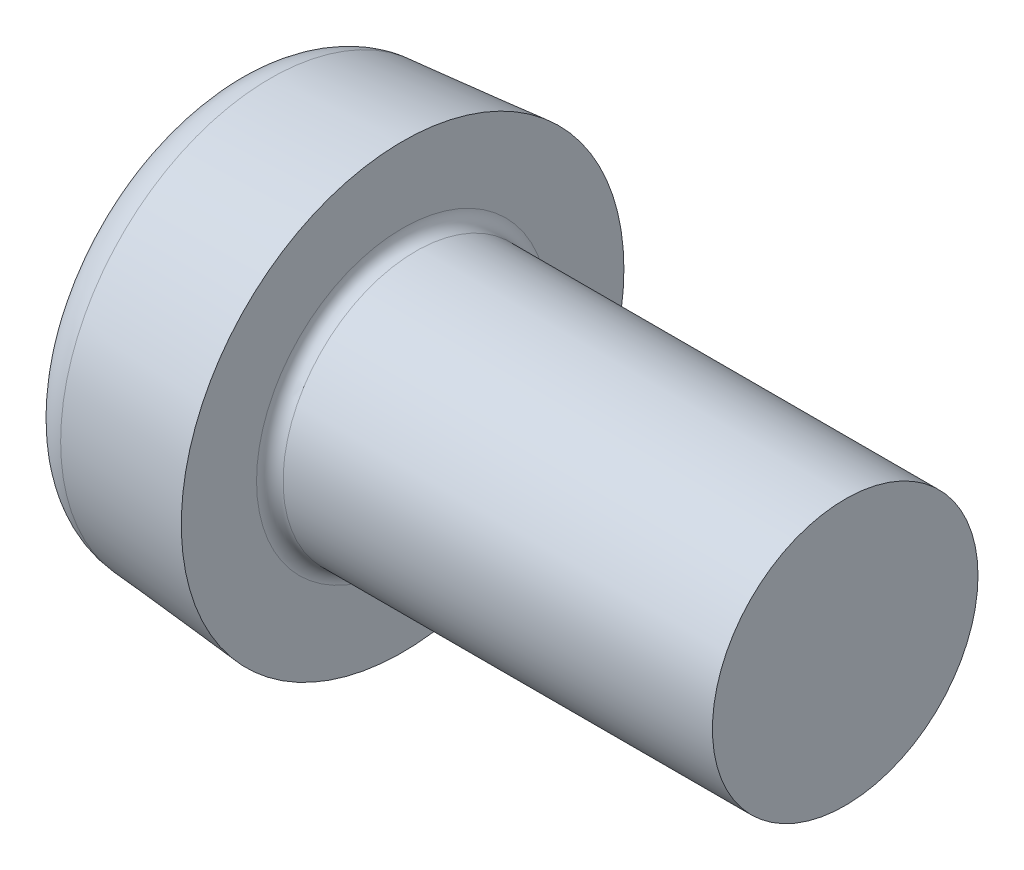
ISO-10303-21;
HEADER;
FILE_DESCRIPTION(('STEP AP214'),'2;1');
FILE_NAME('part.step','',(''),(''),'','','');
FILE_SCHEMA(('AUTOMOTIVE_DESIGN { 1 0 10303 214 1 1 1 1 }'));
ENDSEC;
DATA;
#1=APPLICATION_CONTEXT('core data for automotive mechanical design processes');
#2=APPLICATION_PROTOCOL_DEFINITION('international standard','automotive_design',2000,#1);
#3=PRODUCT_CONTEXT('',#1,'mechanical');
#4=PRODUCT('Part','Part','',(#3));
#5=PRODUCT_RELATED_PRODUCT_CATEGORY('part','',(#4));
#6=PRODUCT_DEFINITION_FORMATION('','',#4);
#7=PRODUCT_DEFINITION_CONTEXT('part definition',#1,'design');
#8=PRODUCT_DEFINITION('design','',#6,#7);
#9=PRODUCT_DEFINITION_SHAPE('','',#8);
#10=(LENGTH_UNIT() NAMED_UNIT(*) SI_UNIT(.MILLI.,.METRE.));
#11=(NAMED_UNIT(*) PLANE_ANGLE_UNIT() SI_UNIT($,.RADIAN.));
#12=(NAMED_UNIT(*) SI_UNIT($,.STERADIAN.) SOLID_ANGLE_UNIT());
#13=UNCERTAINTY_MEASURE_WITH_UNIT(LENGTH_MEASURE(1.E-05),#10,'distance_accuracy_value','');
#14=(GEOMETRIC_REPRESENTATION_CONTEXT(3) GLOBAL_UNCERTAINTY_ASSIGNED_CONTEXT((#13)) GLOBAL_UNIT_ASSIGNED_CONTEXT((#10,
#11,#12)) REPRESENTATION_CONTEXT('',''));
#15=CARTESIAN_POINT('',(0.,0.,0.));
#16=DIRECTION('',(0.,0.,1.));
#17=DIRECTION('',(1.,0.,0.));
#18=AXIS2_PLACEMENT_3D('',#15,#16,#17);
#19=CARTESIAN_POINT('',(0.,0.,0.));
#20=DIRECTION('',(-1.,0.,0.));
#21=DIRECTION('',(0.,0.,0.999999999999996));
#22=AXIS2_PLACEMENT_3D('',#19,#20,#21);
#23=PLANE('',#22);
#24=CARTESIAN_POINT('',(0.,0.,0.));
#25=DIRECTION('',(-1.,0.,0.));
#26=DIRECTION('',(0.,0.,0.999999999999996));
#27=AXIS2_PLACEMENT_3D('',#24,#25,#26);
#28=CIRCLE('',#27,3.74246303823146);
#29=CARTESIAN_POINT('',(0.,0.,3.74246303823145));
#30=VERTEX_POINT('',#29);
#31=EDGE_CURVE('E11',#30,#30,#28,.T.);
#32=ORIENTED_EDGE('',*,*,#31,.T.);
#33=EDGE_LOOP('',(#32));
#34=FACE_BOUND('',#33,.T.);
#35=DIRECTION('',(0.,0.,-0.999999999999997));
#36=VECTOR('',#35,1.);
#37=CARTESIAN_POINT('',(0.,-0.620000000000398,0.620000000000287));
#38=LINE('',#37,#36);
#39=CARTESIAN_POINT('',(0.,-0.620000000000287,3.10000000000021));
#40=VERTEX_POINT('',#39);
#41=CARTESIAN_POINT('',(0.,-0.62000000000037,0.920000000000309));
#42=VERTEX_POINT('',#41);
#43=EDGE_CURVE('E232',#40,#42,#38,.T.);
#44=ORIENTED_EDGE('',*,*,#43,.T.);
#45=CARTESIAN_POINT('',(0.,-0.92000000000042,0.920000000000476));
#46=DIRECTION('',(-1.,0.,0.));
#47=DIRECTION('',(0.,0.,0.999999999999996));
#48=AXIS2_PLACEMENT_3D('',#45,#46,#47);
#49=CIRCLE('',#48,0.3);
#50=CARTESIAN_POINT('',(0.,-0.920000000000198,0.620000000000176));
#51=VERTEX_POINT('',#50);
#52=EDGE_CURVE('E180',#42,#51,#49,.T.);
#53=ORIENTED_EDGE('',*,*,#52,.T.);
#54=DIRECTION('',(0.,-0.999999999999997,0.));
#55=VECTOR('',#54,1.);
#56=CARTESIAN_POINT('',(0.,-0.620000000000398,0.620000000000287));
#57=LINE('',#56,#55);
#58=CARTESIAN_POINT('',(0.,-3.10000000000019,0.620000000000287));
#59=VERTEX_POINT('',#58);
#60=EDGE_CURVE('E229',#51,#59,#57,.T.);
#61=ORIENTED_EDGE('',*,*,#60,.T.);
#62=DIRECTION('',(0.,0.,-0.999999999999996));
#63=VECTOR('',#62,1.);
#64=CARTESIAN_POINT('',(0.,-3.10000000000027,-0.619999999999843));
#65=LINE('',#64,#63);
#66=CARTESIAN_POINT('',(0.,-3.10000000000027,-0.619999999999843));
#67=VERTEX_POINT('',#66);
#68=EDGE_CURVE('E111',#59,#67,#65,.T.);
#69=ORIENTED_EDGE('',*,*,#68,.T.);
#70=DIRECTION('',(0.,0.999999999999996,0.));
#71=VECTOR('',#70,1.);
#72=CARTESIAN_POINT('',(0.,-0.620000000000162,-0.619999999999843));
#73=LINE('',#72,#71);
#74=CARTESIAN_POINT('',(0.,-0.92000000000024,-0.619999999999843));
#75=VERTEX_POINT('',#74);
#76=EDGE_CURVE('E225',#67,#75,#73,.T.);
#77=ORIENTED_EDGE('',*,*,#76,.T.);
#78=CARTESIAN_POINT('',(0.,-0.920000000000129,-0.919999999999699));
#79=DIRECTION('',(-1.,0.,0.));
#80=DIRECTION('',(0.,0.,0.999999999999996));
#81=AXIS2_PLACEMENT_3D('',#78,#79,#80);
#82=CIRCLE('',#81,0.3);
#83=CARTESIAN_POINT('',(0.,-0.620000000000176,-0.91999999999981));
#84=VERTEX_POINT('',#83);
#85=EDGE_CURVE('E183',#75,#84,#82,.T.);
#86=ORIENTED_EDGE('',*,*,#85,.T.);
#87=DIRECTION('',(0.,0.,-0.999999999999996));
#88=VECTOR('',#87,1.);
#89=CARTESIAN_POINT('',(0.,-0.620000000000162,-0.619999999999843));
#90=LINE('',#89,#88);
#91=CARTESIAN_POINT('',(0.,-0.62000000000037,-3.09999999999966));
#92=VERTEX_POINT('',#91);
#93=EDGE_CURVE('E222',#84,#92,#90,.T.);
#94=ORIENTED_EDGE('',*,*,#93,.T.);
#95=DIRECTION('',(0.,0.999999999999996,0.));
#96=VECTOR('',#95,1.);
#97=CARTESIAN_POINT('',(0.,0.619999999999676,-3.0999999999996));
#98=LINE('',#97,#96);
#99=CARTESIAN_POINT('',(0.,0.619999999999676,-3.0999999999996));
#100=VERTEX_POINT('',#99);
#101=EDGE_CURVE('E219',#92,#100,#98,.T.);
#102=ORIENTED_EDGE('',*,*,#101,.T.);
#103=DIRECTION('',(0.,0.,0.999999999999996));
#104=VECTOR('',#103,1.);
#105=CARTESIAN_POINT('',(0.,0.619999999999676,-0.619999999999732));
#106=LINE('',#105,#104);
#107=CARTESIAN_POINT('',(0.,0.619999999999801,-0.919999999999699));
#108=VERTEX_POINT('',#107);
#109=EDGE_CURVE('E216',#100,#108,#106,.T.);
#110=ORIENTED_EDGE('',*,*,#109,.T.);
#111=CARTESIAN_POINT('',(0.,0.919999999999754,-0.91999999999981));
#112=DIRECTION('',(-1.,0.,0.));
#113=DIRECTION('',(0.,0.,0.999999999999996));
#114=AXIS2_PLACEMENT_3D('',#111,#112,#113);
#115=CIRCLE('',#114,0.3);
#116=CARTESIAN_POINT('',(0.,0.919999999999616,-0.619999999999787));
#117=VERTEX_POINT('',#116);
#118=EDGE_CURVE('E189',#108,#117,#115,.T.);
#119=ORIENTED_EDGE('',*,*,#118,.T.);
#120=DIRECTION('',(0.,0.999999999999996,0.));
#121=VECTOR('',#120,1.);
#122=CARTESIAN_POINT('',(0.,0.619999999999676,-0.619999999999732));
#123=LINE('',#122,#121);
#124=CARTESIAN_POINT('',(0.,3.09999999999973,-0.619999999999732));
#125=VERTEX_POINT('',#124);
#126=EDGE_CURVE('E213',#117,#125,#123,.T.);
#127=ORIENTED_EDGE('',*,*,#126,.T.);
#128=DIRECTION('',(0.,0.,0.999999999999996));
#129=VECTOR('',#128,1.);
#130=CARTESIAN_POINT('',(0.,3.09999999999973,-0.619999999999732));
#131=LINE('',#130,#129);
#132=CARTESIAN_POINT('',(0.,3.09999999999985,0.620000000000287));
#133=VERTEX_POINT('',#132);
#134=EDGE_CURVE('E210',#125,#133,#131,.T.);
#135=ORIENTED_EDGE('',*,*,#134,.T.);
#136=DIRECTION('',(0.,-0.999999999999997,0.));
#137=VECTOR('',#136,1.);
#138=CARTESIAN_POINT('',(0.,0.619999999999843,0.620000000000176));
#139=LINE('',#138,#137);
#140=CARTESIAN_POINT('',(0.,0.919999999999851,0.620000000000287));
#141=VERTEX_POINT('',#140);
#142=EDGE_CURVE('E207',#133,#141,#139,.T.);
#143=ORIENTED_EDGE('',*,*,#142,.T.);
#144=CARTESIAN_POINT('',(0.,0.919999999999699,0.920000000000254));
#145=DIRECTION('',(-1.,0.,0.));
#146=DIRECTION('',(0.,0.,0.999999999999996));
#147=AXIS2_PLACEMENT_3D('',#144,#145,#146);
#148=CIRCLE('',#147,0.3);
#149=CARTESIAN_POINT('',(0.,0.619999999999774,0.920000000000254));
#150=VERTEX_POINT('',#149);
#151=EDGE_CURVE('E186',#141,#150,#148,.T.);
#152=ORIENTED_EDGE('',*,*,#151,.T.);
#153=DIRECTION('',(0.,0.,0.999999999999997));
#154=VECTOR('',#153,1.);
#155=CARTESIAN_POINT('',(0.,0.619999999999843,0.620000000000176));
#156=LINE('',#155,#154);
#157=CARTESIAN_POINT('',(0.,0.61999999999969,3.10000000000032));
#158=VERTEX_POINT('',#157);
#159=EDGE_CURVE('E238',#150,#158,#156,.T.);
#160=ORIENTED_EDGE('',*,*,#159,.T.);
#161=DIRECTION('',(0.,-0.999999999999997,0.));
#162=VECTOR('',#161,1.);
#163=CARTESIAN_POINT('',(0.,0.61999999999969,3.10000000000032));
#164=LINE('',#163,#162);
#165=EDGE_CURVE('E235',#158,#40,#164,.T.);
#166=ORIENTED_EDGE('',*,*,#165,.T.);
#167=EDGE_LOOP('',(#44,#53,#61,#69,#77,#86,#94,#102,#110,#119,#127,#135,#143,#152,#160,#166));
#168=FACE_BOUND('',#167,.T.);
#169=ADVANCED_FACE('F39',(#34,#168),#23,.T.);
#170=CARTESIAN_POINT('',(13.9,2.99999999999975,1.66533453693773E-13));
#171=DIRECTION('',(1.,0.,0.));
#172=DIRECTION('',(0.,0.,-0.999999999999996));
#173=AXIS2_PLACEMENT_3D('',#170,#171,#172);
#174=PLANE('',#173);
#175=CARTESIAN_POINT('',(13.9,0.,0.));
#176=DIRECTION('',(1.,0.,0.));
#177=DIRECTION('',(0.,0.,-0.999999999999996));
#178=AXIS2_PLACEMENT_3D('',#175,#176,#177);
#179=CIRCLE('',#178,3.);
#180=CARTESIAN_POINT('',(13.9,0.,-2.99999999999999));
#181=VERTEX_POINT('',#180);
#182=EDGE_CURVE('E195',#181,#181,#179,.T.);
#183=ORIENTED_EDGE('',*,*,#182,.T.);
#184=EDGE_LOOP('',(#183));
#185=FACE_BOUND('',#184,.T.);
#186=ADVANCED_FACE('F357',(#185),#174,.T.);
#187=CARTESIAN_POINT('',(4.51581291088132,0.,0.));
#188=DIRECTION('',(1.,0.,0.));
#189=DIRECTION('',(0.,0.,-0.999999999999996));
#190=AXIS2_PLACEMENT_3D('',#187,#188,#189);
#191=CYLINDRICAL_SURFACE('',#190,3.);
#192=CARTESIAN_POINT('',(4.2,0.,0.));
#193=DIRECTION('',(1.,0.,0.));
#194=DIRECTION('',(0.,0.,-0.999999999999996));
#195=AXIS2_PLACEMENT_3D('',#192,#193,#194);
#196=CIRCLE('',#195,3.);
#197=CARTESIAN_POINT('',(4.2,0.,-2.99999999999999));
#198=VERTEX_POINT('',#197);
#199=EDGE_CURVE('E198',#198,#198,#196,.T.);
#200=ORIENTED_EDGE('',*,*,#199,.T.);
#201=EDGE_LOOP('',(#200));
#202=FACE_BOUND('',#201,.T.);
#203=ORIENTED_EDGE('',*,*,#182,.F.);
#204=EDGE_LOOP('',(#203));
#205=FACE_BOUND('',#204,.T.);
#206=ADVANCED_FACE('F363',(#202,#205),#191,.T.);
#207=CARTESIAN_POINT('',(4.2,0.,0.));
#208=DIRECTION('',(1.,0.,0.));
#209=DIRECTION('',(0.,0.,-0.999999999999996));
#210=AXIS2_PLACEMENT_3D('',#207,#208,#209);
#211=TOROIDAL_SURFACE('',#210,3.3,0.3);
#212=CARTESIAN_POINT('',(3.9,0.,0.));
#213=DIRECTION('',(1.,0.,0.));
#214=DIRECTION('',(0.,0.,-0.999999999999996));
#215=AXIS2_PLACEMENT_3D('',#212,#213,#214);
#216=CIRCLE('',#215,3.3);
#217=CARTESIAN_POINT('',(3.9,0.,-3.29999999999999));
#218=VERTEX_POINT('',#217);
#219=EDGE_CURVE('E201',#218,#218,#216,.T.);
#220=ORIENTED_EDGE('',*,*,#219,.T.);
#221=EDGE_LOOP('',(#220));
#222=FACE_BOUND('',#221,.T.);
#223=ORIENTED_EDGE('',*,*,#199,.F.);
#224=EDGE_LOOP('',(#223));
#225=FACE_BOUND('',#224,.T.);
#226=ADVANCED_FACE('F374',(#222,#225),#211,.F.);
#227=CARTESIAN_POINT('',(3.89999999999998,3.29999999999975,1.66533453693773E-13));
#228=DIRECTION('',(1.,0.,0.));
#229=DIRECTION('',(0.,0.,-0.999999999999996));
#230=AXIS2_PLACEMENT_3D('',#227,#228,#229);
#231=PLANE('',#230);
#232=CARTESIAN_POINT('',(3.9,0.,0.));
#233=DIRECTION('',(1.,0.,0.));
#234=DIRECTION('',(0.,0.,-0.999999999999996));
#235=AXIS2_PLACEMENT_3D('',#232,#233,#234);
#236=CIRCLE('',#235,5.);
#237=CARTESIAN_POINT('',(3.9,0.,-4.99999999999998));
#238=VERTEX_POINT('',#237);
#239=EDGE_CURVE('E146',#238,#238,#236,.T.);
#240=ORIENTED_EDGE('',*,*,#239,.T.);
#241=EDGE_LOOP('',(#240));
#242=FACE_BOUND('',#241,.T.);
#243=ORIENTED_EDGE('',*,*,#219,.F.);
#244=EDGE_LOOP('',(#243));
#245=FACE_BOUND('',#244,.T.);
#246=ADVANCED_FACE('F370',(#242,#245),#231,.T.);
#247=CARTESIAN_POINT('',(3.9,0.,0.));
#248=DIRECTION('',(1.,0.,0.));
#249=DIRECTION('',(0.,0.,-0.999999999999996));
#250=AXIS2_PLACEMENT_3D('',#247,#248,#249);
#251=CONICAL_SURFACE('',#250,5.,0.08726646259972);
#252=CARTESIAN_POINT('',(0.912844257252333,0.,0.));
#253=DIRECTION('',(-1.,0.,0.));
#254=DIRECTION('',(0.,0.,0.999999999999996));
#255=AXIS2_PLACEMENT_3D('',#252,#253,#254);
#256=CIRCLE('',#255,4.73865773632321);
#257=CARTESIAN_POINT('',(0.912844257252333,0.,4.73865773632319));
#258=VERTEX_POINT('',#257);
#259=EDGE_CURVE('E49',#258,#258,#256,.F.);
#260=ORIENTED_EDGE('',*,*,#259,.T.);
#261=EDGE_LOOP('',(#260));
#262=FACE_BOUND('',#261,.T.);
#263=ORIENTED_EDGE('',*,*,#239,.F.);
#264=EDGE_LOOP('',(#263));
#265=FACE_BOUND('',#264,.T.);
#266=ADVANCED_FACE('F367',(#262,#265),#251,.T.);
#267=CARTESIAN_POINT('',(3.89999999999999,0.619999999999843,0.620000000000176));
#268=DIRECTION('',(0.,-0.999999999999997,0.));
#269=DIRECTION('',(0.,0.,-0.999999999999997));
#270=AXIS2_PLACEMENT_3D('',#267,#268,#269);
#271=PLANE('',#270);
#272=ORIENTED_EDGE('',*,*,#159,.F.);
#273=DIRECTION('',(-1.,0.,0.));
#274=VECTOR('',#273,1.);
#275=CARTESIAN_POINT('',(3.89999999999999,0.619999999999774,0.920000000000254));
#276=LINE('',#275,#274);
#277=CARTESIAN_POINT('',(3.89999999999999,0.619999999999774,0.920000000000254));
#278=VERTEX_POINT('',#277);
#279=EDGE_CURVE('E167',#150,#278,#276,.F.);
#280=ORIENTED_EDGE('',*,*,#279,.T.);
#281=DIRECTION('',(0.,0.,0.999999999999997));
#282=VECTOR('',#281,1.);
#283=CARTESIAN_POINT('',(3.89999999999999,0.619999999999843,0.620000000000176));
#284=LINE('',#283,#282);
#285=CARTESIAN_POINT('',(3.89999999999999,0.619999999999801,1.68051608636194));
#286=VERTEX_POINT('',#285);
#287=EDGE_CURVE('E149',#278,#286,#284,.T.);
#288=ORIENTED_EDGE('',*,*,#287,.T.);
#289=DIRECTION('',(-0.939692620785908,0.,0.342020143325668));
#290=VECTOR('',#289,1.);
#291=CARTESIAN_POINT('',(0.,0.61999999999969,3.10000000000032));
#292=LINE('',#291,#290);
#293=EDGE_CURVE('E143',#286,#158,#292,.T.);
#294=ORIENTED_EDGE('',*,*,#293,.T.);
#295=EDGE_LOOP('',(#272,#280,#288,#294));
#296=FACE_BOUND('',#295,.T.);
#297=ADVANCED_FACE('F252',(#296),#271,.T.);
#298=CARTESIAN_POINT('',(0.,0.61999999999969,3.10000000000032));
#299=DIRECTION('',(-0.342020143325669,0.,-0.939692620785904));
#300=DIRECTION('',(-0.939692620785908,0.,0.342020143325669));
#301=AXIS2_PLACEMENT_3D('',#298,#299,#300);
#302=PLANE('',#301);
#303=ORIENTED_EDGE('',*,*,#165,.F.);
#304=ORIENTED_EDGE('',*,*,#293,.F.);
#305=DIRECTION('',(0.,-0.999999999999997,0.));
#306=VECTOR('',#305,1.);
#307=CARTESIAN_POINT('',(3.89999999999999,0.619999999999801,1.68051608636194));
#308=LINE('',#307,#306);
#309=CARTESIAN_POINT('',(3.89999999999999,-0.620000000000329,1.68051608636199));
#310=VERTEX_POINT('',#309);
#311=EDGE_CURVE('E147',#286,#310,#308,.T.);
#312=ORIENTED_EDGE('',*,*,#311,.T.);
#313=DIRECTION('',(-0.939692620785908,0.,0.342020143325668));
#314=VECTOR('',#313,1.);
#315=CARTESIAN_POINT('',(4.24084330009331,-0.620000000000273,1.55645927057912));
#316=LINE('',#315,#314);
#317=EDGE_CURVE('E112',#310,#40,#316,.T.);
#318=ORIENTED_EDGE('',*,*,#317,.T.);
#319=EDGE_LOOP('',(#303,#304,#312,#318));
#320=FACE_BOUND('',#319,.T.);
#321=ADVANCED_FACE('F261',(#320),#302,.T.);
#322=CARTESIAN_POINT('',(3.9,-0.620000000000398,0.620000000000287));
#323=DIRECTION('',(0.,0.999999999999997,0.));
#324=DIRECTION('',(0.,0.,0.999999999999997));
#325=AXIS2_PLACEMENT_3D('',#322,#323,#324);
#326=PLANE('',#325);
#327=DIRECTION('',(0.,0.,-0.999999999999997));
#328=VECTOR('',#327,1.);
#329=CARTESIAN_POINT('',(3.9,-0.620000000000398,0.620000000000287));
#330=LINE('',#329,#328);
#331=CARTESIAN_POINT('',(3.89999999999999,-0.62000000000037,0.920000000000309));
#332=VERTEX_POINT('',#331);
#333=EDGE_CURVE('E107',#310,#332,#330,.T.);
#334=ORIENTED_EDGE('',*,*,#333,.T.);
#335=DIRECTION('',(-1.,0.,0.));
#336=VECTOR('',#335,1.);
#337=CARTESIAN_POINT('',(3.89999999999999,-0.62000000000037,0.920000000000309));
#338=LINE('',#337,#336);
#339=EDGE_CURVE('E192',#332,#42,#338,.T.);
#340=ORIENTED_EDGE('',*,*,#339,.T.);
#341=ORIENTED_EDGE('',*,*,#43,.F.);
#342=ORIENTED_EDGE('',*,*,#317,.F.);
#343=EDGE_LOOP('',(#334,#340,#341,#342));
#344=FACE_BOUND('',#343,.T.);
#345=ADVANCED_FACE('F346',(#344),#326,.T.);
#346=CARTESIAN_POINT('',(3.9,-0.620000000000398,0.620000000000287));
#347=DIRECTION('',(0.,0.,-0.999999999999997));
#348=DIRECTION('',(0.,0.999999999999997,0.));
#349=AXIS2_PLACEMENT_3D('',#346,#347,#348);
#350=PLANE('',#349);
#351=ORIENTED_EDGE('',*,*,#60,.F.);
#352=DIRECTION('',(-1.,0.,0.));
#353=VECTOR('',#352,1.);
#354=CARTESIAN_POINT('',(3.9,-0.920000000000198,0.620000000000176));
#355=LINE('',#354,#353);
#356=CARTESIAN_POINT('',(3.9,-0.920000000000198,0.620000000000176));
#357=VERTEX_POINT('',#356);
#358=EDGE_CURVE('E103',#51,#357,#355,.F.);
#359=ORIENTED_EDGE('',*,*,#358,.T.);
#360=DIRECTION('',(0.,-0.999999999999997,0.));
#361=VECTOR('',#360,1.);
#362=CARTESIAN_POINT('',(3.9,-0.620000000000398,0.620000000000287));
#363=LINE('',#362,#361);
#364=CARTESIAN_POINT('',(3.9,-1.68051608636201,0.620000000000287));
#365=VERTEX_POINT('',#364);
#366=EDGE_CURVE('E96',#357,#365,#363,.T.);
#367=ORIENTED_EDGE('',*,*,#366,.T.);
#368=DIRECTION('',(-0.939692620785908,-0.342020143325669,0.));
#369=VECTOR('',#368,1.);
#370=CARTESIAN_POINT('',(0.,-3.10000000000019,0.620000000000287));
#371=LINE('',#370,#369);
#372=EDGE_CURVE('E43',#365,#59,#371,.T.);
#373=ORIENTED_EDGE('',*,*,#372,.T.);
#374=EDGE_LOOP('',(#351,#359,#367,#373));
#375=FACE_BOUND('',#374,.T.);
#376=ADVANCED_FACE('F98',(#375),#350,.T.);
#377=CARTESIAN_POINT('',(0.,-3.10000000000027,-0.619999999999843));
#378=DIRECTION('',(-0.342020143325669,0.939692620785904,0.));
#379=DIRECTION('',(-0.939692620785908,-0.342020143325669,0.));
#380=AXIS2_PLACEMENT_3D('',#377,#378,#379);
#381=PLANE('',#380);
#382=ORIENTED_EDGE('',*,*,#68,.F.);
#383=ORIENTED_EDGE('',*,*,#372,.F.);
#384=DIRECTION('',(0.,0.,-0.999999999999996));
#385=VECTOR('',#384,1.);
#386=CARTESIAN_POINT('',(3.9,-1.68051608636187,-0.619999999999954));
#387=LINE('',#386,#385);
#388=CARTESIAN_POINT('',(3.9,-1.68051608636187,-0.619999999999954));
#389=VERTEX_POINT('',#388);
#390=EDGE_CURVE('E89',#365,#389,#387,.T.);
#391=ORIENTED_EDGE('',*,*,#390,.T.);
#392=DIRECTION('',(-0.939692620785908,-0.342020143325669,0.));
#393=VECTOR('',#392,1.);
#394=CARTESIAN_POINT('',(4.24084330009332,-1.55645927057893,-0.619999999999843));
#395=LINE('',#394,#393);
#396=EDGE_CURVE('E113',#389,#67,#395,.T.);
#397=ORIENTED_EDGE('',*,*,#396,.T.);
#398=EDGE_LOOP('',(#382,#383,#391,#397));
#399=FACE_BOUND('',#398,.T.);
#400=ADVANCED_FACE('F109',(#399),#381,.T.);
#401=CARTESIAN_POINT('',(3.9,-0.620000000000162,-0.619999999999843));
#402=DIRECTION('',(0.,0.,0.999999999999996));
#403=DIRECTION('',(1.,0.,0.));
#404=AXIS2_PLACEMENT_3D('',#401,#402,#403);
#405=PLANE('',#404);
#406=DIRECTION('',(0.,0.999999999999996,0.));
#407=VECTOR('',#406,1.);
#408=CARTESIAN_POINT('',(3.9,-0.620000000000162,-0.619999999999843));
#409=LINE('',#408,#407);
#410=CARTESIAN_POINT('',(3.9,-0.92000000000024,-0.619999999999843));
#411=VERTEX_POINT('',#410);
#412=EDGE_CURVE('E119',#389,#411,#409,.T.);
#413=ORIENTED_EDGE('',*,*,#412,.T.);
#414=DIRECTION('',(-1.,0.,0.));
#415=VECTOR('',#414,1.);
#416=CARTESIAN_POINT('',(3.9,-0.92000000000024,-0.619999999999843));
#417=LINE('',#416,#415);
#418=EDGE_CURVE('E176',#411,#75,#417,.T.);
#419=ORIENTED_EDGE('',*,*,#418,.T.);
#420=ORIENTED_EDGE('',*,*,#76,.F.);
#421=ORIENTED_EDGE('',*,*,#396,.F.);
#422=EDGE_LOOP('',(#413,#419,#420,#421));
#423=FACE_BOUND('',#422,.T.);
#424=ADVANCED_FACE('F341',(#423),#405,.T.);
#425=CARTESIAN_POINT('',(3.9,-0.620000000000162,-0.619999999999843));
#426=DIRECTION('',(0.,0.999999999999996,0.));
#427=DIRECTION('',(0.,0.,0.999999999999996));
#428=AXIS2_PLACEMENT_3D('',#425,#426,#427);
#429=PLANE('',#428);
#430=ORIENTED_EDGE('',*,*,#93,.F.);
#431=DIRECTION('',(-1.,0.,0.));
#432=VECTOR('',#431,1.);
#433=CARTESIAN_POINT('',(3.9,-0.620000000000176,-0.91999999999981));
#434=LINE('',#433,#432);
#435=CARTESIAN_POINT('',(3.9,-0.620000000000176,-0.91999999999981));
#436=VERTEX_POINT('',#435);
#437=EDGE_CURVE('E173',#84,#436,#434,.F.);
#438=ORIENTED_EDGE('',*,*,#437,.T.);
#439=DIRECTION('',(0.,0.,-0.999999999999996));
#440=VECTOR('',#439,1.);
#441=CARTESIAN_POINT('',(3.9,-0.620000000000162,-0.619999999999843));
#442=LINE('',#441,#440);
#443=CARTESIAN_POINT('',(3.9,-0.620000000000218,-1.68051608636166));
#444=VERTEX_POINT('',#443);
#445=EDGE_CURVE('E120',#436,#444,#442,.T.);
#446=ORIENTED_EDGE('',*,*,#445,.T.);
#447=DIRECTION('',(-0.939692620785908,0.,-0.342020143325668));
#448=VECTOR('',#447,1.);
#449=CARTESIAN_POINT('',(0.,-0.62000000000037,-3.09999999999966));
#450=LINE('',#449,#448);
#451=EDGE_CURVE('E124',#444,#92,#450,.T.);
#452=ORIENTED_EDGE('',*,*,#451,.T.);
#453=EDGE_LOOP('',(#430,#438,#446,#452));
#454=FACE_BOUND('',#453,.T.);
#455=ADVANCED_FACE('F396',(#454),#429,.T.);
#456=CARTESIAN_POINT('',(0.,0.619999999999676,-3.0999999999996));
#457=DIRECTION('',(-0.342020143325669,0.,0.939692620785905));
#458=DIRECTION('',(0.939692620785908,0.,0.342020143325668));
#459=AXIS2_PLACEMENT_3D('',#456,#457,#458);
#460=PLANE('',#459);
#461=ORIENTED_EDGE('',*,*,#101,.F.);
#462=ORIENTED_EDGE('',*,*,#451,.F.);
#463=DIRECTION('',(0.,0.999999999999996,0.));
#464=VECTOR('',#463,1.);
#465=CARTESIAN_POINT('',(3.9,0.619999999999926,-1.68051608636161));
#466=LINE('',#465,#464);
#467=CARTESIAN_POINT('',(3.9,0.619999999999926,-1.68051608636161));
#468=VERTEX_POINT('',#467);
#469=EDGE_CURVE('E128',#444,#468,#466,.T.);
#470=ORIENTED_EDGE('',*,*,#469,.T.);
#471=DIRECTION('',(-0.939692620785908,0.,-0.342020143325668));
#472=VECTOR('',#471,1.);
#473=CARTESIAN_POINT('',(4.24084330009332,0.619999999999857,-1.55645927057863));
#474=LINE('',#473,#472);
#475=EDGE_CURVE('E127',#468,#100,#474,.T.);
#476=ORIENTED_EDGE('',*,*,#475,.T.);
#477=EDGE_LOOP('',(#461,#462,#470,#476));
#478=FACE_BOUND('',#477,.T.);
#479=ADVANCED_FACE('F330',(#478),#460,.T.);
#480=CARTESIAN_POINT('',(3.89999999999999,0.619999999999676,-0.619999999999732));
#481=DIRECTION('',(0.,-0.999999999999996,0.));
#482=DIRECTION('',(0.,0.,-0.999999999999996));
#483=AXIS2_PLACEMENT_3D('',#480,#481,#482);
#484=PLANE('',#483);
#485=DIRECTION('',(0.,0.,0.999999999999996));
#486=VECTOR('',#485,1.);
#487=CARTESIAN_POINT('',(3.89999999999999,0.619999999999676,-0.619999999999732));
#488=LINE('',#487,#486);
#489=CARTESIAN_POINT('',(3.9,0.619999999999801,-0.919999999999699));
#490=VERTEX_POINT('',#489);
#491=EDGE_CURVE('E130',#468,#490,#488,.T.);
#492=ORIENTED_EDGE('',*,*,#491,.T.);
#493=DIRECTION('',(-1.,0.,0.));
#494=VECTOR('',#493,1.);
#495=CARTESIAN_POINT('',(3.9,0.619999999999801,-0.919999999999699));
#496=LINE('',#495,#494);
#497=EDGE_CURVE('E164',#490,#108,#496,.T.);
#498=ORIENTED_EDGE('',*,*,#497,.T.);
#499=ORIENTED_EDGE('',*,*,#109,.F.);
#500=ORIENTED_EDGE('',*,*,#475,.F.);
#501=EDGE_LOOP('',(#492,#498,#499,#500));
#502=FACE_BOUND('',#501,.T.);
#503=ADVANCED_FACE('F324',(#502),#484,.T.);
#504=CARTESIAN_POINT('',(3.89999999999999,0.619999999999676,-0.619999999999732));
#505=DIRECTION('',(0.,0.,0.999999999999996));
#506=DIRECTION('',(1.,0.,0.));
#507=AXIS2_PLACEMENT_3D('',#504,#505,#506);
#508=PLANE('',#507);
#509=ORIENTED_EDGE('',*,*,#126,.F.);
#510=DIRECTION('',(-1.,0.,0.));
#511=VECTOR('',#510,1.);
#512=CARTESIAN_POINT('',(3.89999999999999,0.919999999999616,-0.619999999999787));
#513=LINE('',#512,#511);
#514=CARTESIAN_POINT('',(3.89999999999999,0.919999999999616,-0.619999999999787));
#515=VERTEX_POINT('',#514);
#516=EDGE_CURVE('E58',#117,#515,#513,.F.);
#517=ORIENTED_EDGE('',*,*,#516,.T.);
#518=DIRECTION('',(0.,0.999999999999996,0.));
#519=VECTOR('',#518,1.);
#520=CARTESIAN_POINT('',(3.89999999999999,0.619999999999676,-0.619999999999732));
#521=LINE('',#520,#519);
#522=CARTESIAN_POINT('',(3.89999999999999,1.68051608636161,-0.619999999999843));
#523=VERTEX_POINT('',#522);
#524=EDGE_CURVE('E140',#515,#523,#521,.T.);
#525=ORIENTED_EDGE('',*,*,#524,.T.);
#526=DIRECTION('',(-0.939692620785908,0.342020143325667,0.));
#527=VECTOR('',#526,1.);
#528=CARTESIAN_POINT('',(0.,3.09999999999973,-0.619999999999732));
#529=LINE('',#528,#527);
#530=EDGE_CURVE('E133',#523,#125,#529,.T.);
#531=ORIENTED_EDGE('',*,*,#530,.T.);
#532=EDGE_LOOP('',(#509,#517,#525,#531));
#533=FACE_BOUND('',#532,.T.);
#534=ADVANCED_FACE('F401',(#533),#508,.T.);
#535=CARTESIAN_POINT('',(0.,3.09999999999973,-0.619999999999732));
#536=DIRECTION('',(-0.342020143325669,-0.939692620785904,0.));
#537=DIRECTION('',(0.939692620785908,-0.342020143325667,0.));
#538=AXIS2_PLACEMENT_3D('',#535,#536,#537);
#539=PLANE('',#538);
#540=ORIENTED_EDGE('',*,*,#134,.F.);
#541=ORIENTED_EDGE('',*,*,#530,.F.);
#542=DIRECTION('',(0.,0.,0.999999999999996));
#543=VECTOR('',#542,1.);
#544=CARTESIAN_POINT('',(3.89999999999999,1.68051608636161,-0.619999999999843));
#545=LINE('',#544,#543);
#546=CARTESIAN_POINT('',(3.89999999999999,1.68051608636154,0.620000000000176));
#547=VERTEX_POINT('',#546);
#548=EDGE_CURVE('E137',#523,#547,#545,.T.);
#549=ORIENTED_EDGE('',*,*,#548,.T.);
#550=DIRECTION('',(-0.939692620785908,0.342020143325667,0.));
#551=VECTOR('',#550,1.);
#552=CARTESIAN_POINT('',(4.24084330009331,1.55645927057851,0.620000000000287));
#553=LINE('',#552,#551);
#554=EDGE_CURVE('E136',#547,#133,#553,.T.);
#555=ORIENTED_EDGE('',*,*,#554,.T.);
#556=EDGE_LOOP('',(#540,#541,#549,#555));
#557=FACE_BOUND('',#556,.T.);
#558=ADVANCED_FACE('F41',(#557),#539,.T.);
#559=CARTESIAN_POINT('',(3.89999999999999,0.619999999999843,0.620000000000176));
#560=DIRECTION('',(0.,0.,-0.999999999999997));
#561=DIRECTION('',(0.,0.999999999999997,0.));
#562=AXIS2_PLACEMENT_3D('',#559,#560,#561);
#563=PLANE('',#562);
#564=DIRECTION('',(0.,-0.999999999999997,0.));
#565=VECTOR('',#564,1.);
#566=CARTESIAN_POINT('',(3.89999999999999,0.619999999999843,0.620000000000176));
#567=LINE('',#566,#565);
#568=CARTESIAN_POINT('',(3.89999999999999,0.919999999999851,0.620000000000287));
#569=VERTEX_POINT('',#568);
#570=EDGE_CURVE('E139',#547,#569,#567,.T.);
#571=ORIENTED_EDGE('',*,*,#570,.T.);
#572=DIRECTION('',(-1.,0.,0.));
#573=VECTOR('',#572,1.);
#574=CARTESIAN_POINT('',(3.89999999999999,0.919999999999851,0.620000000000287));
#575=LINE('',#574,#573);
#576=EDGE_CURVE('E170',#569,#141,#575,.T.);
#577=ORIENTED_EDGE('',*,*,#576,.T.);
#578=ORIENTED_EDGE('',*,*,#142,.F.);
#579=ORIENTED_EDGE('',*,*,#554,.F.);
#580=EDGE_LOOP('',(#571,#577,#578,#579));
#581=FACE_BOUND('',#580,.T.);
#582=ADVANCED_FACE('F311',(#581),#563,.T.);
#583=CARTESIAN_POINT('',(3.89999999999999,0.619999999999843,0.620000000000176));
#584=DIRECTION('',(1.,0.,0.));
#585=DIRECTION('',(0.,0.,-0.999999999999996));
#586=AXIS2_PLACEMENT_3D('',#583,#584,#585);
#587=PLANE('',#586);
#588=ORIENTED_EDGE('',*,*,#287,.F.);
#589=CARTESIAN_POINT('',(3.89999999999999,0.919999999999699,0.920000000000254));
#590=DIRECTION('',(1.,0.,0.));
#591=DIRECTION('',(0.,0.,-0.999999999999996));
#592=AXIS2_PLACEMENT_3D('',#589,#590,#591);
#593=CIRCLE('',#592,0.3);
#594=EDGE_CURVE('E156',#278,#569,#593,.T.);
#595=ORIENTED_EDGE('',*,*,#594,.T.);
#596=ORIENTED_EDGE('',*,*,#570,.F.);
#597=ORIENTED_EDGE('',*,*,#548,.F.);
#598=ORIENTED_EDGE('',*,*,#524,.F.);
#599=CARTESIAN_POINT('',(3.89999999999999,0.919999999999754,-0.91999999999981));
#600=DIRECTION('',(1.,0.,0.));
#601=DIRECTION('',(0.,0.,-0.999999999999996));
#602=AXIS2_PLACEMENT_3D('',#599,#600,#601);
#603=CIRCLE('',#602,0.3);
#604=EDGE_CURVE('E154',#515,#490,#603,.T.);
#605=ORIENTED_EDGE('',*,*,#604,.T.);
#606=ORIENTED_EDGE('',*,*,#491,.F.);
#607=ORIENTED_EDGE('',*,*,#469,.F.);
#608=ORIENTED_EDGE('',*,*,#445,.F.);
#609=CARTESIAN_POINT('',(3.9,-0.920000000000129,-0.919999999999699));
#610=DIRECTION('',(1.,0.,0.));
#611=DIRECTION('',(0.,0.,-0.999999999999996));
#612=AXIS2_PLACEMENT_3D('',#609,#610,#611);
#613=CIRCLE('',#612,0.3);
#614=EDGE_CURVE('E159',#436,#411,#613,.T.);
#615=ORIENTED_EDGE('',*,*,#614,.T.);
#616=ORIENTED_EDGE('',*,*,#412,.F.);
#617=ORIENTED_EDGE('',*,*,#390,.F.);
#618=ORIENTED_EDGE('',*,*,#366,.F.);
#619=CARTESIAN_POINT('',(3.9,-0.92000000000042,0.920000000000476));
#620=DIRECTION('',(1.,0.,0.));
#621=DIRECTION('',(0.,0.,-0.999999999999996));
#622=AXIS2_PLACEMENT_3D('',#619,#620,#621);
#623=CIRCLE('',#622,0.3);
#624=EDGE_CURVE('E161',#357,#332,#623,.T.);
#625=ORIENTED_EDGE('',*,*,#624,.T.);
#626=ORIENTED_EDGE('',*,*,#333,.F.);
#627=ORIENTED_EDGE('',*,*,#311,.F.);
#628=EDGE_LOOP('',(#588,#595,#596,#597,#598,#605,#606,#607,#608,#615,#616,#617,#618,#625,#626,#627));
#629=FACE_BOUND('',#628,.T.);
#630=ADVANCED_FACE('F116',(#629),#587,.F.);
#631=CARTESIAN_POINT('',(3.9,-0.92000000000042,0.920000000000476));
#632=DIRECTION('',(-1.,0.,0.));
#633=DIRECTION('',(0.,0.,0.999999999999996));
#634=AXIS2_PLACEMENT_3D('',#631,#632,#633);
#635=CYLINDRICAL_SURFACE('',#634,0.3);
#636=ORIENTED_EDGE('',*,*,#624,.F.);
#637=ORIENTED_EDGE('',*,*,#358,.F.);
#638=ORIENTED_EDGE('',*,*,#52,.F.);
#639=ORIENTED_EDGE('',*,*,#339,.F.);
#640=EDGE_LOOP('',(#636,#637,#638,#639));
#641=FACE_BOUND('',#640,.T.);
#642=ADVANCED_FACE('F343',(#641),#635,.T.);
#643=CARTESIAN_POINT('',(3.9,-0.920000000000129,-0.919999999999699));
#644=DIRECTION('',(-1.,0.,0.));
#645=DIRECTION('',(0.,0.,0.999999999999996));
#646=AXIS2_PLACEMENT_3D('',#643,#644,#645);
#647=CYLINDRICAL_SURFACE('',#646,0.3);
#648=ORIENTED_EDGE('',*,*,#614,.F.);
#649=ORIENTED_EDGE('',*,*,#437,.F.);
#650=ORIENTED_EDGE('',*,*,#85,.F.);
#651=ORIENTED_EDGE('',*,*,#418,.F.);
#652=EDGE_LOOP('',(#648,#649,#650,#651));
#653=FACE_BOUND('',#652,.T.);
#654=ADVANCED_FACE('F338',(#653),#647,.T.);
#655=CARTESIAN_POINT('',(3.89999999999999,0.919999999999699,0.920000000000254));
#656=DIRECTION('',(-1.,0.,0.));
#657=DIRECTION('',(0.,0.,0.999999999999996));
#658=AXIS2_PLACEMENT_3D('',#655,#656,#657);
#659=CYLINDRICAL_SURFACE('',#658,0.3);
#660=ORIENTED_EDGE('',*,*,#594,.F.);
#661=ORIENTED_EDGE('',*,*,#279,.F.);
#662=ORIENTED_EDGE('',*,*,#151,.F.);
#663=ORIENTED_EDGE('',*,*,#576,.F.);
#664=EDGE_LOOP('',(#660,#661,#662,#663));
#665=FACE_BOUND('',#664,.T.);
#666=ADVANCED_FACE('F313',(#665),#659,.T.);
#667=CARTESIAN_POINT('',(3.89999999999999,0.919999999999754,-0.91999999999981));
#668=DIRECTION('',(-1.,0.,0.));
#669=DIRECTION('',(0.,0.,0.999999999999996));
#670=AXIS2_PLACEMENT_3D('',#667,#668,#669);
#671=CYLINDRICAL_SURFACE('',#670,0.3);
#672=ORIENTED_EDGE('',*,*,#604,.F.);
#673=ORIENTED_EDGE('',*,*,#516,.F.);
#674=ORIENTED_EDGE('',*,*,#118,.F.);
#675=ORIENTED_EDGE('',*,*,#497,.F.);
#676=EDGE_LOOP('',(#672,#673,#674,#675));
#677=FACE_BOUND('',#676,.T.);
#678=ADVANCED_FACE('F321',(#677),#671,.T.);
#679=CARTESIAN_POINT('',(1.,0.,0.));
#680=DIRECTION('',(-1.,0.,0.));
#681=DIRECTION('',(0.,0.,0.999999999999996));
#682=AXIS2_PLACEMENT_3D('',#679,#680,#681);
#683=TOROIDAL_SURFACE('',#682,3.74246303823146,1.);
#684=ORIENTED_EDGE('',*,*,#31,.F.);
#685=EDGE_LOOP('',(#684));
#686=FACE_BOUND('',#685,.T.);
#687=ORIENTED_EDGE('',*,*,#259,.F.);
#688=EDGE_LOOP('',(#687));
#689=FACE_BOUND('',#688,.T.);
#690=ADVANCED_FACE('F390',(#686,#689),#683,.T.);
#691=CLOSED_SHELL('',(#169,#186,#206,#226,#246,#266,#297,#321,#345,#376,#400,#424,#455,#479,
#503,#534,#558,#582,#630,#642,#654,#666,#678,#690));
#692=MANIFOLD_SOLID_BREP('B2',#691);
#693=ADVANCED_BREP_SHAPE_REPRESENTATION('',(#18,#692),#14);
#694=SHAPE_DEFINITION_REPRESENTATION(#9,#693);
ENDSEC;
END-ISO-10303-21;
